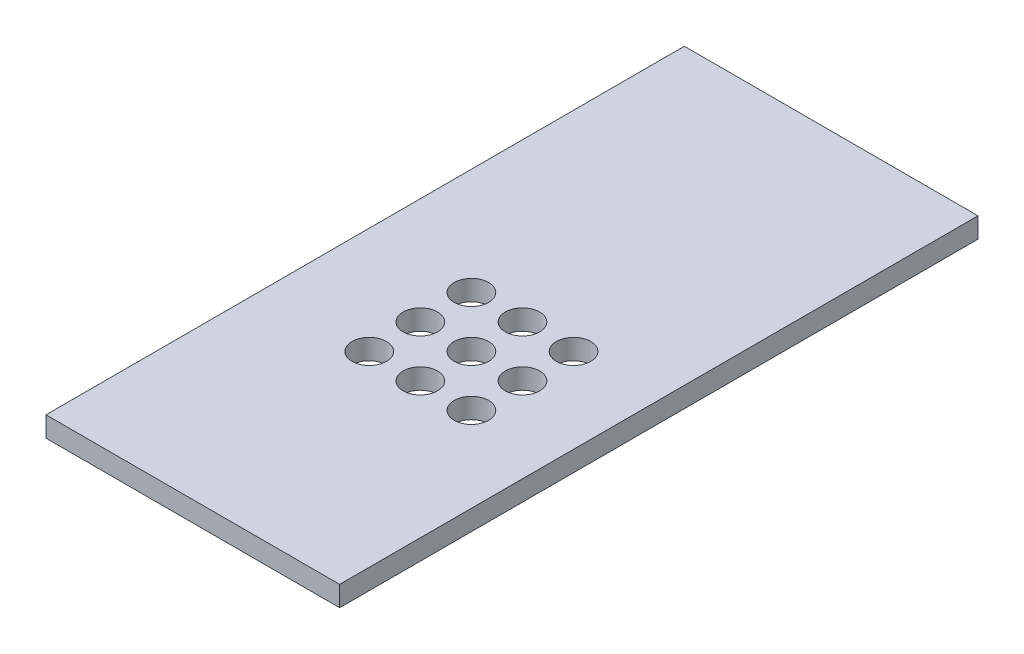
ISO-10303-21;
HEADER;
FILE_DESCRIPTION(('STEP AP214'),'2;1');
FILE_NAME('part.step','',(''),(''),'','','');
FILE_SCHEMA(('AUTOMOTIVE_DESIGN { 1 0 10303 214 1 1 1 1 }'));
ENDSEC;
DATA;
#1=APPLICATION_CONTEXT('core data for automotive mechanical design processes');
#2=APPLICATION_PROTOCOL_DEFINITION('international standard','automotive_design',2000,#1);
#3=PRODUCT_CONTEXT('',#1,'mechanical');
#4=PRODUCT('Part','Part','',(#3));
#5=PRODUCT_RELATED_PRODUCT_CATEGORY('part','',(#4));
#6=PRODUCT_DEFINITION_FORMATION('','',#4);
#7=PRODUCT_DEFINITION_CONTEXT('part definition',#1,'design');
#8=PRODUCT_DEFINITION('design','',#6,#7);
#9=PRODUCT_DEFINITION_SHAPE('','',#8);
#10=(LENGTH_UNIT() NAMED_UNIT(*) SI_UNIT(.MILLI.,.METRE.));
#11=(NAMED_UNIT(*) PLANE_ANGLE_UNIT() SI_UNIT($,.RADIAN.));
#12=(NAMED_UNIT(*) SI_UNIT($,.STERADIAN.) SOLID_ANGLE_UNIT());
#13=UNCERTAINTY_MEASURE_WITH_UNIT(LENGTH_MEASURE(1.E-05),#10,'distance_accuracy_value','');
#14=(GEOMETRIC_REPRESENTATION_CONTEXT(3) GLOBAL_UNCERTAINTY_ASSIGNED_CONTEXT((#13)) GLOBAL_UNIT_ASSIGNED_CONTEXT((#10,
#11,#12)) REPRESENTATION_CONTEXT('',''));
#15=CARTESIAN_POINT('',(0.,0.,0.));
#16=DIRECTION('',(0.,0.,1.));
#17=DIRECTION('',(1.,0.,0.));
#18=AXIS2_PLACEMENT_3D('',#15,#16,#17);
#19=CARTESIAN_POINT('',(0.,1.5875,-50.));
#20=DIRECTION('',(0.,-1.,0.));
#21=DIRECTION('',(0.,0.,-1.));
#22=AXIS2_PLACEMENT_3D('',#19,#20,#21);
#23=PLANE('',#22);
#24=CARTESIAN_POINT('',(12.36,1.5875,-24.96));
#25=DIRECTION('',(0.,1.,0.));
#26=DIRECTION('',(0.,0.,1.));
#27=AXIS2_PLACEMENT_3D('',#24,#25,#26);
#28=CIRCLE('',#27,1.35);
#29=CARTESIAN_POINT('',(12.36,1.5875,-23.61));
#30=VERTEX_POINT('',#29);
#31=EDGE_CURVE('E150',#30,#30,#28,.T.);
#32=ORIENTED_EDGE('',*,*,#31,.F.);
#33=EDGE_LOOP('',(#32));
#34=FACE_BOUND('',#33,.T.);
#35=CARTESIAN_POINT('',(16.36,1.5875,-20.96));
#36=DIRECTION('',(0.,1.,0.));
#37=DIRECTION('',(0.,0.,1.));
#38=AXIS2_PLACEMENT_3D('',#35,#36,#37);
#39=CIRCLE('',#38,1.35);
#40=CARTESIAN_POINT('',(16.36,1.5875,-19.61));
#41=VERTEX_POINT('',#40);
#42=EDGE_CURVE('E138',#41,#41,#39,.T.);
#43=ORIENTED_EDGE('',*,*,#42,.F.);
#44=EDGE_LOOP('',(#43));
#45=FACE_BOUND('',#44,.T.);
#46=CARTESIAN_POINT('',(8.35999999999999,1.5875,-20.96));
#47=DIRECTION('',(0.,1.,0.));
#48=DIRECTION('',(0.,0.,1.));
#49=AXIS2_PLACEMENT_3D('',#46,#47,#48);
#50=CIRCLE('',#49,1.35);
#51=CARTESIAN_POINT('',(8.35999999999999,1.5875,-19.61));
#52=VERTEX_POINT('',#51);
#53=EDGE_CURVE('E126',#52,#52,#50,.T.);
#54=ORIENTED_EDGE('',*,*,#53,.F.);
#55=EDGE_LOOP('',(#54));
#56=FACE_BOUND('',#55,.T.);
#57=CARTESIAN_POINT('',(12.36,1.5875,-16.96));
#58=DIRECTION('',(0.,1.,0.));
#59=DIRECTION('',(0.,0.,1.));
#60=AXIS2_PLACEMENT_3D('',#57,#58,#59);
#61=CIRCLE('',#60,1.35);
#62=CARTESIAN_POINT('',(12.36,1.5875,-15.61));
#63=VERTEX_POINT('',#62);
#64=EDGE_CURVE('E114',#63,#63,#61,.T.);
#65=ORIENTED_EDGE('',*,*,#64,.F.);
#66=EDGE_LOOP('',(#65));
#67=FACE_BOUND('',#66,.T.);
#68=DIRECTION('',(0.,0.,1.));
#69=VECTOR('',#68,1.);
#70=CARTESIAN_POINT('',(0.,1.5875,0.));
#71=LINE('',#70,#69);
#72=CARTESIAN_POINT('',(0.,1.5875,-50.));
#73=VERTEX_POINT('',#72);
#74=CARTESIAN_POINT('',(0.,1.5875,0.));
#75=VERTEX_POINT('',#74);
#76=EDGE_CURVE('E84',#73,#75,#71,.T.);
#77=ORIENTED_EDGE('',*,*,#76,.T.);
#78=DIRECTION('',(1.,0.,0.));
#79=VECTOR('',#78,1.);
#80=CARTESIAN_POINT('',(0.,1.5875,0.));
#81=LINE('',#80,#79);
#82=CARTESIAN_POINT('',(23.,1.5875,0.));
#83=VERTEX_POINT('',#82);
#84=EDGE_CURVE('E79',#75,#83,#81,.T.);
#85=ORIENTED_EDGE('',*,*,#84,.T.);
#86=DIRECTION('',(0.,0.,-1.));
#87=VECTOR('',#86,1.);
#88=CARTESIAN_POINT('',(23.,1.5875,0.));
#89=LINE('',#88,#87);
#90=CARTESIAN_POINT('',(23.,1.5875,-50.));
#91=VERTEX_POINT('',#90);
#92=EDGE_CURVE('E82',#83,#91,#89,.T.);
#93=ORIENTED_EDGE('',*,*,#92,.T.);
#94=DIRECTION('',(-1.,0.,0.));
#95=VECTOR('',#94,1.);
#96=CARTESIAN_POINT('',(0.,1.5875,-50.));
#97=LINE('',#96,#95);
#98=EDGE_CURVE('E49',#91,#73,#97,.T.);
#99=ORIENTED_EDGE('',*,*,#98,.T.);
#100=EDGE_LOOP('',(#77,#85,#93,#99));
#101=FACE_BOUND('',#100,.T.);
#102=CARTESIAN_POINT('',(8.36,1.5875,-16.96));
#103=DIRECTION('',(0.,1.,0.));
#104=DIRECTION('',(0.,0.,1.));
#105=AXIS2_PLACEMENT_3D('',#102,#103,#104);
#106=CIRCLE('',#105,1.35);
#107=CARTESIAN_POINT('',(8.36,1.5875,-15.61));
#108=VERTEX_POINT('',#107);
#109=EDGE_CURVE('E99',#108,#108,#106,.T.);
#110=ORIENTED_EDGE('',*,*,#109,.F.);
#111=EDGE_LOOP('',(#110));
#112=FACE_BOUND('',#111,.T.);
#113=CARTESIAN_POINT('',(16.36,1.5875,-16.96));
#114=DIRECTION('',(0.,1.,0.));
#115=DIRECTION('',(0.,0.,1.));
#116=AXIS2_PLACEMENT_3D('',#113,#114,#115);
#117=CIRCLE('',#116,1.35);
#118=CARTESIAN_POINT('',(16.36,1.5875,-15.61));
#119=VERTEX_POINT('',#118);
#120=EDGE_CURVE('E120',#119,#119,#117,.T.);
#121=ORIENTED_EDGE('',*,*,#120,.F.);
#122=EDGE_LOOP('',(#121));
#123=FACE_BOUND('',#122,.T.);
#124=CARTESIAN_POINT('',(12.36,1.5875,-20.96));
#125=DIRECTION('',(0.,1.,0.));
#126=DIRECTION('',(0.,0.,1.));
#127=AXIS2_PLACEMENT_3D('',#124,#125,#126);
#128=CIRCLE('',#127,1.35);
#129=CARTESIAN_POINT('',(12.36,1.5875,-19.61));
#130=VERTEX_POINT('',#129);
#131=EDGE_CURVE('E132',#130,#130,#128,.T.);
#132=ORIENTED_EDGE('',*,*,#131,.F.);
#133=EDGE_LOOP('',(#132));
#134=FACE_BOUND('',#133,.T.);
#135=CARTESIAN_POINT('',(8.35999999999997,1.5875,-24.96));
#136=DIRECTION('',(0.,1.,0.));
#137=DIRECTION('',(0.,0.,1.));
#138=AXIS2_PLACEMENT_3D('',#135,#136,#137);
#139=CIRCLE('',#138,1.35);
#140=CARTESIAN_POINT('',(8.35999999999997,1.5875,-23.61));
#141=VERTEX_POINT('',#140);
#142=EDGE_CURVE('E144',#141,#141,#139,.T.);
#143=ORIENTED_EDGE('',*,*,#142,.F.);
#144=EDGE_LOOP('',(#143));
#145=FACE_BOUND('',#144,.T.);
#146=CARTESIAN_POINT('',(16.36,1.5875,-24.96));
#147=DIRECTION('',(0.,1.,0.));
#148=DIRECTION('',(0.,0.,1.));
#149=AXIS2_PLACEMENT_3D('',#146,#147,#148);
#150=CIRCLE('',#149,1.35);
#151=CARTESIAN_POINT('',(16.36,1.5875,-23.61));
#152=VERTEX_POINT('',#151);
#153=EDGE_CURVE('E156',#152,#152,#150,.T.);
#154=ORIENTED_EDGE('',*,*,#153,.F.);
#155=EDGE_LOOP('',(#154));
#156=FACE_BOUND('',#155,.T.);
#157=ADVANCED_FACE('F32',(#34,#45,#56,#67,#101,#112,#123,#134,#145,#156),#23,.F.);
#158=CARTESIAN_POINT('',(0.,0.,-50.));
#159=DIRECTION('',(0.,-1.,0.));
#160=DIRECTION('',(0.,0.,-1.));
#161=AXIS2_PLACEMENT_3D('',#158,#159,#160);
#162=PLANE('',#161);
#163=CARTESIAN_POINT('',(12.36,0.,-24.96));
#164=DIRECTION('',(0.,1.,0.));
#165=DIRECTION('',(0.,0.,1.));
#166=AXIS2_PLACEMENT_3D('',#163,#164,#165);
#167=CIRCLE('',#166,1.35);
#168=CARTESIAN_POINT('',(12.36,0.,-23.61));
#169=VERTEX_POINT('',#168);
#170=EDGE_CURVE('E153',#169,#169,#167,.T.);
#171=ORIENTED_EDGE('',*,*,#170,.T.);
#172=EDGE_LOOP('',(#171));
#173=FACE_BOUND('',#172,.T.);
#174=CARTESIAN_POINT('',(16.36,0.,-20.96));
#175=DIRECTION('',(0.,1.,0.));
#176=DIRECTION('',(0.,0.,1.));
#177=AXIS2_PLACEMENT_3D('',#174,#175,#176);
#178=CIRCLE('',#177,1.35);
#179=CARTESIAN_POINT('',(16.36,0.,-19.61));
#180=VERTEX_POINT('',#179);
#181=EDGE_CURVE('E141',#180,#180,#178,.T.);
#182=ORIENTED_EDGE('',*,*,#181,.T.);
#183=EDGE_LOOP('',(#182));
#184=FACE_BOUND('',#183,.T.);
#185=CARTESIAN_POINT('',(8.35999999999999,0.,-20.96));
#186=DIRECTION('',(0.,1.,0.));
#187=DIRECTION('',(0.,0.,1.));
#188=AXIS2_PLACEMENT_3D('',#185,#186,#187);
#189=CIRCLE('',#188,1.35);
#190=CARTESIAN_POINT('',(8.35999999999999,0.,-19.61));
#191=VERTEX_POINT('',#190);
#192=EDGE_CURVE('E129',#191,#191,#189,.T.);
#193=ORIENTED_EDGE('',*,*,#192,.T.);
#194=EDGE_LOOP('',(#193));
#195=FACE_BOUND('',#194,.T.);
#196=CARTESIAN_POINT('',(12.36,0.,-16.96));
#197=DIRECTION('',(0.,1.,0.));
#198=DIRECTION('',(0.,0.,1.));
#199=AXIS2_PLACEMENT_3D('',#196,#197,#198);
#200=CIRCLE('',#199,1.35);
#201=CARTESIAN_POINT('',(12.36,0.,-15.61));
#202=VERTEX_POINT('',#201);
#203=EDGE_CURVE('E117',#202,#202,#200,.T.);
#204=ORIENTED_EDGE('',*,*,#203,.T.);
#205=EDGE_LOOP('',(#204));
#206=FACE_BOUND('',#205,.T.);
#207=DIRECTION('',(0.,0.,1.));
#208=VECTOR('',#207,1.);
#209=CARTESIAN_POINT('',(0.,0.,0.));
#210=LINE('',#209,#208);
#211=CARTESIAN_POINT('',(0.,0.,-50.));
#212=VERTEX_POINT('',#211);
#213=CARTESIAN_POINT('',(0.,0.,0.));
#214=VERTEX_POINT('',#213);
#215=EDGE_CURVE('E96',#212,#214,#210,.T.);
#216=ORIENTED_EDGE('',*,*,#215,.F.);
#217=DIRECTION('',(-1.,0.,0.));
#218=VECTOR('',#217,1.);
#219=CARTESIAN_POINT('',(0.,0.,-50.));
#220=LINE('',#219,#218);
#221=CARTESIAN_POINT('',(23.,0.,-50.));
#222=VERTEX_POINT('',#221);
#223=EDGE_CURVE('E72',#222,#212,#220,.T.);
#224=ORIENTED_EDGE('',*,*,#223,.F.);
#225=DIRECTION('',(0.,0.,-1.));
#226=VECTOR('',#225,1.);
#227=CARTESIAN_POINT('',(23.,0.,0.));
#228=LINE('',#227,#226);
#229=CARTESIAN_POINT('',(23.,0.,0.));
#230=VERTEX_POINT('',#229);
#231=EDGE_CURVE('E66',#230,#222,#228,.T.);
#232=ORIENTED_EDGE('',*,*,#231,.F.);
#233=DIRECTION('',(1.,0.,0.));
#234=VECTOR('',#233,1.);
#235=CARTESIAN_POINT('',(0.,0.,0.));
#236=LINE('',#235,#234);
#237=EDGE_CURVE('E88',#214,#230,#236,.T.);
#238=ORIENTED_EDGE('',*,*,#237,.F.);
#239=EDGE_LOOP('',(#216,#224,#232,#238));
#240=FACE_BOUND('',#239,.T.);
#241=CARTESIAN_POINT('',(8.36,0.,-16.96));
#242=DIRECTION('',(0.,1.,0.));
#243=DIRECTION('',(0.,0.,1.));
#244=AXIS2_PLACEMENT_3D('',#241,#242,#243);
#245=CIRCLE('',#244,1.35);
#246=CARTESIAN_POINT('',(8.36,0.,-15.61));
#247=VERTEX_POINT('',#246);
#248=EDGE_CURVE('E111',#247,#247,#245,.T.);
#249=ORIENTED_EDGE('',*,*,#248,.T.);
#250=EDGE_LOOP('',(#249));
#251=FACE_BOUND('',#250,.T.);
#252=CARTESIAN_POINT('',(16.36,0.,-16.96));
#253=DIRECTION('',(0.,1.,0.));
#254=DIRECTION('',(0.,0.,1.));
#255=AXIS2_PLACEMENT_3D('',#252,#253,#254);
#256=CIRCLE('',#255,1.35);
#257=CARTESIAN_POINT('',(16.36,0.,-15.61));
#258=VERTEX_POINT('',#257);
#259=EDGE_CURVE('E123',#258,#258,#256,.T.);
#260=ORIENTED_EDGE('',*,*,#259,.T.);
#261=EDGE_LOOP('',(#260));
#262=FACE_BOUND('',#261,.T.);
#263=CARTESIAN_POINT('',(12.36,0.,-20.96));
#264=DIRECTION('',(0.,1.,0.));
#265=DIRECTION('',(0.,0.,1.));
#266=AXIS2_PLACEMENT_3D('',#263,#264,#265);
#267=CIRCLE('',#266,1.35);
#268=CARTESIAN_POINT('',(12.36,0.,-19.61));
#269=VERTEX_POINT('',#268);
#270=EDGE_CURVE('E135',#269,#269,#267,.T.);
#271=ORIENTED_EDGE('',*,*,#270,.T.);
#272=EDGE_LOOP('',(#271));
#273=FACE_BOUND('',#272,.T.);
#274=CARTESIAN_POINT('',(8.35999999999997,0.,-24.96));
#275=DIRECTION('',(0.,1.,0.));
#276=DIRECTION('',(0.,0.,1.));
#277=AXIS2_PLACEMENT_3D('',#274,#275,#276);
#278=CIRCLE('',#277,1.35);
#279=CARTESIAN_POINT('',(8.35999999999997,0.,-23.61));
#280=VERTEX_POINT('',#279);
#281=EDGE_CURVE('E147',#280,#280,#278,.T.);
#282=ORIENTED_EDGE('',*,*,#281,.T.);
#283=EDGE_LOOP('',(#282));
#284=FACE_BOUND('',#283,.T.);
#285=CARTESIAN_POINT('',(16.36,0.,-24.96));
#286=DIRECTION('',(0.,1.,0.));
#287=DIRECTION('',(0.,0.,1.));
#288=AXIS2_PLACEMENT_3D('',#285,#286,#287);
#289=CIRCLE('',#288,1.35);
#290=CARTESIAN_POINT('',(16.36,0.,-23.61));
#291=VERTEX_POINT('',#290);
#292=EDGE_CURVE('E159',#291,#291,#289,.T.);
#293=ORIENTED_EDGE('',*,*,#292,.T.);
#294=EDGE_LOOP('',(#293));
#295=FACE_BOUND('',#294,.T.);
#296=ADVANCED_FACE('F107',(#173,#184,#195,#206,#240,#251,#262,#273,#284,#295),#162,.T.);
#297=CARTESIAN_POINT('',(0.,1.5875,0.));
#298=DIRECTION('',(1.,0.,0.));
#299=DIRECTION('',(0.,0.,-1.));
#300=AXIS2_PLACEMENT_3D('',#297,#298,#299);
#301=PLANE('',#300);
#302=ORIENTED_EDGE('',*,*,#215,.T.);
#303=DIRECTION('',(0.,-1.,0.));
#304=VECTOR('',#303,1.);
#305=CARTESIAN_POINT('',(0.,1.5875,0.));
#306=LINE('',#305,#304);
#307=EDGE_CURVE('E11',#75,#214,#306,.T.);
#308=ORIENTED_EDGE('',*,*,#307,.F.);
#309=ORIENTED_EDGE('',*,*,#76,.F.);
#310=DIRECTION('',(0.,-1.,0.));
#311=VECTOR('',#310,1.);
#312=CARTESIAN_POINT('',(0.,1.5875,-50.));
#313=LINE('',#312,#311);
#314=EDGE_CURVE('E92',#73,#212,#313,.T.);
#315=ORIENTED_EDGE('',*,*,#314,.T.);
#316=EDGE_LOOP('',(#302,#308,#309,#315));
#317=FACE_BOUND('',#316,.T.);
#318=ADVANCED_FACE('F34',(#317),#301,.F.);
#319=CARTESIAN_POINT('',(0.,1.5875,0.));
#320=DIRECTION('',(0.,0.,-1.));
#321=DIRECTION('',(-1.,0.,0.));
#322=AXIS2_PLACEMENT_3D('',#319,#320,#321);
#323=PLANE('',#322);
#324=ORIENTED_EDGE('',*,*,#237,.T.);
#325=DIRECTION('',(0.,-1.,0.));
#326=VECTOR('',#325,1.);
#327=CARTESIAN_POINT('',(23.,1.5875,0.));
#328=LINE('',#327,#326);
#329=EDGE_CURVE('E41',#83,#230,#328,.T.);
#330=ORIENTED_EDGE('',*,*,#329,.F.);
#331=ORIENTED_EDGE('',*,*,#84,.F.);
#332=ORIENTED_EDGE('',*,*,#307,.T.);
#333=EDGE_LOOP('',(#324,#330,#331,#332));
#334=FACE_BOUND('',#333,.T.);
#335=ADVANCED_FACE('F87',(#334),#323,.F.);
#336=CARTESIAN_POINT('',(23.,1.5875,0.));
#337=DIRECTION('',(-1.,0.,0.));
#338=DIRECTION('',(0.,0.,1.));
#339=AXIS2_PLACEMENT_3D('',#336,#337,#338);
#340=PLANE('',#339);
#341=ORIENTED_EDGE('',*,*,#231,.T.);
#342=DIRECTION('',(0.,-1.,0.));
#343=VECTOR('',#342,1.);
#344=CARTESIAN_POINT('',(23.,1.5875,-50.));
#345=LINE('',#344,#343);
#346=EDGE_CURVE('E89',#91,#222,#345,.T.);
#347=ORIENTED_EDGE('',*,*,#346,.F.);
#348=ORIENTED_EDGE('',*,*,#92,.F.);
#349=ORIENTED_EDGE('',*,*,#329,.T.);
#350=EDGE_LOOP('',(#341,#347,#348,#349));
#351=FACE_BOUND('',#350,.T.);
#352=ADVANCED_FACE('F90',(#351),#340,.F.);
#353=CARTESIAN_POINT('',(0.,1.5875,-50.));
#354=DIRECTION('',(0.,0.,1.));
#355=DIRECTION('',(1.,0.,0.));
#356=AXIS2_PLACEMENT_3D('',#353,#354,#355);
#357=PLANE('',#356);
#358=ORIENTED_EDGE('',*,*,#223,.T.);
#359=ORIENTED_EDGE('',*,*,#314,.F.);
#360=ORIENTED_EDGE('',*,*,#98,.F.);
#361=ORIENTED_EDGE('',*,*,#346,.T.);
#362=EDGE_LOOP('',(#358,#359,#360,#361));
#363=FACE_BOUND('',#362,.T.);
#364=ADVANCED_FACE('F104',(#363),#357,.F.);
#365=CARTESIAN_POINT('',(8.36,1.5875,-16.96));
#366=DIRECTION('',(0.,-1.,0.));
#367=DIRECTION('',(0.,0.,-1.));
#368=AXIS2_PLACEMENT_3D('',#365,#366,#367);
#369=CYLINDRICAL_SURFACE('',#368,1.35);
#370=ORIENTED_EDGE('',*,*,#109,.T.);
#371=EDGE_LOOP('',(#370));
#372=FACE_BOUND('',#371,.T.);
#373=ORIENTED_EDGE('',*,*,#248,.F.);
#374=EDGE_LOOP('',(#373));
#375=FACE_BOUND('',#374,.T.);
#376=ADVANCED_FACE('F179',(#372,#375),#369,.F.);
#377=CARTESIAN_POINT('',(12.36,1.5875,-16.96));
#378=DIRECTION('',(0.,-1.,0.));
#379=DIRECTION('',(0.,0.,-1.));
#380=AXIS2_PLACEMENT_3D('',#377,#378,#379);
#381=CYLINDRICAL_SURFACE('',#380,1.35);
#382=ORIENTED_EDGE('',*,*,#64,.T.);
#383=EDGE_LOOP('',(#382));
#384=FACE_BOUND('',#383,.T.);
#385=ORIENTED_EDGE('',*,*,#203,.F.);
#386=EDGE_LOOP('',(#385));
#387=FACE_BOUND('',#386,.T.);
#388=ADVANCED_FACE('F225',(#384,#387),#381,.F.);
#389=CARTESIAN_POINT('',(16.36,1.5875,-16.96));
#390=DIRECTION('',(0.,-1.,0.));
#391=DIRECTION('',(0.,0.,-1.));
#392=AXIS2_PLACEMENT_3D('',#389,#390,#391);
#393=CYLINDRICAL_SURFACE('',#392,1.35);
#394=ORIENTED_EDGE('',*,*,#120,.T.);
#395=EDGE_LOOP('',(#394));
#396=FACE_BOUND('',#395,.T.);
#397=ORIENTED_EDGE('',*,*,#259,.F.);
#398=EDGE_LOOP('',(#397));
#399=FACE_BOUND('',#398,.T.);
#400=ADVANCED_FACE('F233',(#396,#399),#393,.F.);
#401=CARTESIAN_POINT('',(8.35999999999999,1.5875,-20.96));
#402=DIRECTION('',(0.,-1.,0.));
#403=DIRECTION('',(0.,0.,-1.));
#404=AXIS2_PLACEMENT_3D('',#401,#402,#403);
#405=CYLINDRICAL_SURFACE('',#404,1.35);
#406=ORIENTED_EDGE('',*,*,#53,.T.);
#407=EDGE_LOOP('',(#406));
#408=FACE_BOUND('',#407,.T.);
#409=ORIENTED_EDGE('',*,*,#192,.F.);
#410=EDGE_LOOP('',(#409));
#411=FACE_BOUND('',#410,.T.);
#412=ADVANCED_FACE('F241',(#408,#411),#405,.F.);
#413=CARTESIAN_POINT('',(12.36,1.5875,-20.96));
#414=DIRECTION('',(0.,-1.,0.));
#415=DIRECTION('',(0.,0.,-1.));
#416=AXIS2_PLACEMENT_3D('',#413,#414,#415);
#417=CYLINDRICAL_SURFACE('',#416,1.35);
#418=ORIENTED_EDGE('',*,*,#131,.T.);
#419=EDGE_LOOP('',(#418));
#420=FACE_BOUND('',#419,.T.);
#421=ORIENTED_EDGE('',*,*,#270,.F.);
#422=EDGE_LOOP('',(#421));
#423=FACE_BOUND('',#422,.T.);
#424=ADVANCED_FACE('F250',(#420,#423),#417,.F.);
#425=CARTESIAN_POINT('',(16.36,1.5875,-20.96));
#426=DIRECTION('',(0.,-1.,0.));
#427=DIRECTION('',(0.,0.,-1.));
#428=AXIS2_PLACEMENT_3D('',#425,#426,#427);
#429=CYLINDRICAL_SURFACE('',#428,1.35);
#430=ORIENTED_EDGE('',*,*,#42,.T.);
#431=EDGE_LOOP('',(#430));
#432=FACE_BOUND('',#431,.T.);
#433=ORIENTED_EDGE('',*,*,#181,.F.);
#434=EDGE_LOOP('',(#433));
#435=FACE_BOUND('',#434,.T.);
#436=ADVANCED_FACE('F259',(#432,#435),#429,.F.);
#437=CARTESIAN_POINT('',(8.35999999999997,1.5875,-24.96));
#438=DIRECTION('',(0.,-1.,0.));
#439=DIRECTION('',(0.,0.,-1.));
#440=AXIS2_PLACEMENT_3D('',#437,#438,#439);
#441=CYLINDRICAL_SURFACE('',#440,1.35);
#442=ORIENTED_EDGE('',*,*,#142,.T.);
#443=EDGE_LOOP('',(#442));
#444=FACE_BOUND('',#443,.T.);
#445=ORIENTED_EDGE('',*,*,#281,.F.);
#446=EDGE_LOOP('',(#445));
#447=FACE_BOUND('',#446,.T.);
#448=ADVANCED_FACE('F268',(#444,#447),#441,.F.);
#449=CARTESIAN_POINT('',(12.36,1.5875,-24.96));
#450=DIRECTION('',(0.,-1.,0.));
#451=DIRECTION('',(0.,0.,-1.));
#452=AXIS2_PLACEMENT_3D('',#449,#450,#451);
#453=CYLINDRICAL_SURFACE('',#452,1.35);
#454=ORIENTED_EDGE('',*,*,#31,.T.);
#455=EDGE_LOOP('',(#454));
#456=FACE_BOUND('',#455,.T.);
#457=ORIENTED_EDGE('',*,*,#170,.F.);
#458=EDGE_LOOP('',(#457));
#459=FACE_BOUND('',#458,.T.);
#460=ADVANCED_FACE('F277',(#456,#459),#453,.F.);
#461=CARTESIAN_POINT('',(16.36,1.5875,-24.96));
#462=DIRECTION('',(0.,-1.,0.));
#463=DIRECTION('',(0.,0.,-1.));
#464=AXIS2_PLACEMENT_3D('',#461,#462,#463);
#465=CYLINDRICAL_SURFACE('',#464,1.35);
#466=ORIENTED_EDGE('',*,*,#153,.T.);
#467=EDGE_LOOP('',(#466));
#468=FACE_BOUND('',#467,.T.);
#469=ORIENTED_EDGE('',*,*,#292,.F.);
#470=EDGE_LOOP('',(#469));
#471=FACE_BOUND('',#470,.T.);
#472=ADVANCED_FACE('F165',(#468,#471),#465,.F.);
#473=CLOSED_SHELL('',(#157,#296,#318,#335,#352,#364,#376,#388,#400,#412,#424,#436,#448,#460,#472));
#474=MANIFOLD_SOLID_BREP('B2',#473);
#475=ADVANCED_BREP_SHAPE_REPRESENTATION('',(#18,#474),#14);
#476=SHAPE_DEFINITION_REPRESENTATION(#9,#475);
ENDSEC;
END-ISO-10303-21;
